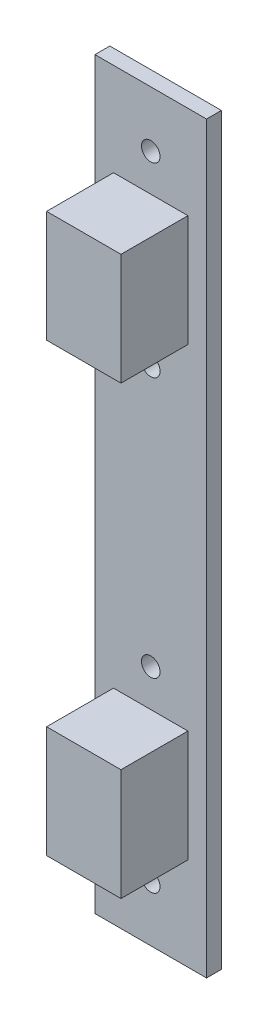
ISO-10303-21;
HEADER;
FILE_DESCRIPTION(('STEP AP214'),'2;1');
FILE_NAME('part.step','',(''),(''),'','','');
FILE_SCHEMA(('AUTOMOTIVE_DESIGN { 1 0 10303 214 1 1 1 1 }'));
ENDSEC;
DATA;
#1=APPLICATION_CONTEXT('core data for automotive mechanical design processes');
#2=APPLICATION_PROTOCOL_DEFINITION('international standard','automotive_design',2000,#1);
#3=PRODUCT_CONTEXT('',#1,'mechanical');
#4=PRODUCT('Part','Part','',(#3));
#5=PRODUCT_RELATED_PRODUCT_CATEGORY('part','',(#4));
#6=PRODUCT_DEFINITION_FORMATION('','',#4);
#7=PRODUCT_DEFINITION_CONTEXT('part definition',#1,'design');
#8=PRODUCT_DEFINITION('design','',#6,#7);
#9=PRODUCT_DEFINITION_SHAPE('','',#8);
#10=(LENGTH_UNIT() NAMED_UNIT(*) SI_UNIT(.MILLI.,.METRE.));
#11=(NAMED_UNIT(*) PLANE_ANGLE_UNIT() SI_UNIT($,.RADIAN.));
#12=(NAMED_UNIT(*) SI_UNIT($,.STERADIAN.) SOLID_ANGLE_UNIT());
#13=UNCERTAINTY_MEASURE_WITH_UNIT(LENGTH_MEASURE(1.E-05),#10,'distance_accuracy_value','');
#14=(GEOMETRIC_REPRESENTATION_CONTEXT(3) GLOBAL_UNCERTAINTY_ASSIGNED_CONTEXT((#13)) GLOBAL_UNIT_ASSIGNED_CONTEXT((#10,
#11,#12)) REPRESENTATION_CONTEXT('',''));
#15=CARTESIAN_POINT('',(0.,0.,0.));
#16=DIRECTION('',(0.,0.,1.));
#17=DIRECTION('',(1.,0.,0.));
#18=AXIS2_PLACEMENT_3D('',#15,#16,#17);
#19=CARTESIAN_POINT('',(0.,0.,0.));
#20=DIRECTION('',(0.,0.,-1.));
#21=DIRECTION('',(-1.,0.,0.));
#22=AXIS2_PLACEMENT_3D('',#19,#20,#21);
#23=PLANE('',#22);
#24=DIRECTION('',(0.,1.,0.));
#25=VECTOR('',#24,1.);
#26=CARTESIAN_POINT('',(5.,22.5,0.));
#27=LINE('',#26,#25);
#28=CARTESIAN_POINT('',(5.,22.5,0.));
#29=VERTEX_POINT('',#28);
#30=CARTESIAN_POINT('',(5.,37.5,0.));
#31=VERTEX_POINT('',#30);
#32=EDGE_CURVE('E146',#29,#31,#27,.T.);
#33=ORIENTED_EDGE('',*,*,#32,.F.);
#34=DIRECTION('',(1.,0.,0.));
#35=VECTOR('',#34,1.);
#36=CARTESIAN_POINT('',(-5.,22.5,0.));
#37=LINE('',#36,#35);
#38=CARTESIAN_POINT('',(-5.,22.5,0.));
#39=VERTEX_POINT('',#38);
#40=EDGE_CURVE('E159',#39,#29,#37,.T.);
#41=ORIENTED_EDGE('',*,*,#40,.F.);
#42=DIRECTION('',(0.,-1.,0.));
#43=VECTOR('',#42,1.);
#44=CARTESIAN_POINT('',(-5.,22.5,0.));
#45=LINE('',#44,#43);
#46=CARTESIAN_POINT('',(-5.,37.5,0.));
#47=VERTEX_POINT('',#46);
#48=EDGE_CURVE('E168',#47,#39,#45,.T.);
#49=ORIENTED_EDGE('',*,*,#48,.F.);
#50=DIRECTION('',(-1.,0.,0.));
#51=VECTOR('',#50,1.);
#52=CARTESIAN_POINT('',(-5.,37.5,0.));
#53=LINE('',#52,#51);
#54=EDGE_CURVE('E149',#31,#47,#53,.T.);
#55=ORIENTED_EDGE('',*,*,#54,.F.);
#56=EDGE_LOOP('',(#33,#41,#49,#55));
#57=FACE_BOUND('',#56,.T.);
#58=CARTESIAN_POINT('',(0.,-17.5,0.));
#59=DIRECTION('',(0.,0.,1.));
#60=DIRECTION('',(-1.,0.,0.));
#61=AXIS2_PLACEMENT_3D('',#58,#59,#60);
#62=CIRCLE('',#61,1.25);
#63=CARTESIAN_POINT('',(-1.25,-17.5,0.));
#64=VERTEX_POINT('',#63);
#65=EDGE_CURVE('E184',#64,#64,#62,.T.);
#66=ORIENTED_EDGE('',*,*,#65,.F.);
#67=EDGE_LOOP('',(#66));
#68=FACE_BOUND('',#67,.T.);
#69=CARTESIAN_POINT('',(0.,-42.5,0.));
#70=DIRECTION('',(0.,0.,1.));
#71=DIRECTION('',(-1.,0.,0.));
#72=AXIS2_PLACEMENT_3D('',#69,#70,#71);
#73=CIRCLE('',#72,1.25);
#74=CARTESIAN_POINT('',(-1.25,-42.5,0.));
#75=VERTEX_POINT('',#74);
#76=EDGE_CURVE('E188',#75,#75,#73,.T.);
#77=ORIENTED_EDGE('',*,*,#76,.F.);
#78=EDGE_LOOP('',(#77));
#79=FACE_BOUND('',#78,.T.);
#80=CARTESIAN_POINT('',(0.,17.5,0.));
#81=DIRECTION('',(0.,0.,1.));
#82=DIRECTION('',(1.,0.,0.));
#83=AXIS2_PLACEMENT_3D('',#80,#81,#82);
#84=CIRCLE('',#83,1.25);
#85=CARTESIAN_POINT('',(1.25,17.5,0.));
#86=VERTEX_POINT('',#85);
#87=EDGE_CURVE('E194',#86,#86,#84,.T.);
#88=ORIENTED_EDGE('',*,*,#87,.F.);
#89=EDGE_LOOP('',(#88));
#90=FACE_BOUND('',#89,.T.);
#91=CARTESIAN_POINT('',(0.,42.5,0.));
#92=DIRECTION('',(0.,0.,1.));
#93=DIRECTION('',(1.,0.,0.));
#94=AXIS2_PLACEMENT_3D('',#91,#92,#93);
#95=CIRCLE('',#94,1.25);
#96=CARTESIAN_POINT('',(1.25,42.5,0.));
#97=VERTEX_POINT('',#96);
#98=EDGE_CURVE('E200',#97,#97,#95,.T.);
#99=ORIENTED_EDGE('',*,*,#98,.F.);
#100=EDGE_LOOP('',(#99));
#101=FACE_BOUND('',#100,.T.);
#102=DIRECTION('',(0.,1.,0.));
#103=VECTOR('',#102,1.);
#104=CARTESIAN_POINT('',(7.5,-50.,0.));
#105=LINE('',#104,#103);
#106=CARTESIAN_POINT('',(7.5,-50.,0.));
#107=VERTEX_POINT('',#106);
#108=CARTESIAN_POINT('',(7.5,50.,0.));
#109=VERTEX_POINT('',#108);
#110=EDGE_CURVE('E206',#107,#109,#105,.T.);
#111=ORIENTED_EDGE('',*,*,#110,.T.);
#112=DIRECTION('',(-1.,0.,0.));
#113=VECTOR('',#112,1.);
#114=CARTESIAN_POINT('',(-7.5,50.,0.));
#115=LINE('',#114,#113);
#116=CARTESIAN_POINT('',(-7.5,50.,0.));
#117=VERTEX_POINT('',#116);
#118=EDGE_CURVE('E224',#109,#117,#115,.T.);
#119=ORIENTED_EDGE('',*,*,#118,.T.);
#120=DIRECTION('',(0.,-1.,0.));
#121=VECTOR('',#120,1.);
#122=CARTESIAN_POINT('',(-7.5,-50.,0.));
#123=LINE('',#122,#121);
#124=CARTESIAN_POINT('',(-7.5,-50.,0.));
#125=VERTEX_POINT('',#124);
#126=EDGE_CURVE('E227',#117,#125,#123,.T.);
#127=ORIENTED_EDGE('',*,*,#126,.T.);
#128=DIRECTION('',(1.,0.,0.));
#129=VECTOR('',#128,1.);
#130=CARTESIAN_POINT('',(-7.5,-50.,0.));
#131=LINE('',#130,#129);
#132=EDGE_CURVE('E213',#125,#107,#131,.T.);
#133=ORIENTED_EDGE('',*,*,#132,.T.);
#134=EDGE_LOOP('',(#111,#119,#127,#133));
#135=FACE_BOUND('',#134,.T.);
#136=DIRECTION('',(0.,-1.,0.));
#137=VECTOR('',#136,1.);
#138=CARTESIAN_POINT('',(-5.,-22.5,0.));
#139=LINE('',#138,#137);
#140=CARTESIAN_POINT('',(-5.,-22.5,0.));
#141=VERTEX_POINT('',#140);
#142=CARTESIAN_POINT('',(-5.,-37.5,0.));
#143=VERTEX_POINT('',#142);
#144=EDGE_CURVE('E145',#141,#143,#139,.T.);
#145=ORIENTED_EDGE('',*,*,#144,.F.);
#146=DIRECTION('',(-1.,0.,0.));
#147=VECTOR('',#146,1.);
#148=CARTESIAN_POINT('',(-5.,-22.5,0.));
#149=LINE('',#148,#147);
#150=CARTESIAN_POINT('',(5.,-22.5,0.));
#151=VERTEX_POINT('',#150);
#152=EDGE_CURVE('E142',#151,#141,#149,.T.);
#153=ORIENTED_EDGE('',*,*,#152,.F.);
#154=DIRECTION('',(0.,1.,0.));
#155=VECTOR('',#154,1.);
#156=CARTESIAN_POINT('',(5.,-22.5,0.));
#157=LINE('',#156,#155);
#158=CARTESIAN_POINT('',(5.,-37.5,0.));
#159=VERTEX_POINT('',#158);
#160=EDGE_CURVE('E57',#159,#151,#157,.T.);
#161=ORIENTED_EDGE('',*,*,#160,.F.);
#162=DIRECTION('',(1.,0.,0.));
#163=VECTOR('',#162,1.);
#164=CARTESIAN_POINT('',(-5.,-37.5,0.));
#165=LINE('',#164,#163);
#166=EDGE_CURVE('E52',#143,#159,#165,.T.);
#167=ORIENTED_EDGE('',*,*,#166,.F.);
#168=EDGE_LOOP('',(#145,#153,#161,#167));
#169=FACE_BOUND('',#168,.T.);
#170=ADVANCED_FACE('F35',(#57,#68,#79,#90,#101,#135,#169),#23,.F.);
#171=CARTESIAN_POINT('',(7.5,-50.,-2.));
#172=DIRECTION('',(1.,0.,0.));
#173=DIRECTION('',(0.,0.,-1.));
#174=AXIS2_PLACEMENT_3D('',#171,#172,#173);
#175=PLANE('',#174);
#176=ORIENTED_EDGE('',*,*,#110,.F.);
#177=DIRECTION('',(0.,0.,1.));
#178=VECTOR('',#177,1.);
#179=CARTESIAN_POINT('',(7.5,-50.,-2.));
#180=LINE('',#179,#178);
#181=CARTESIAN_POINT('',(7.5,-50.,-2.));
#182=VERTEX_POINT('',#181);
#183=EDGE_CURVE('E11',#182,#107,#180,.T.);
#184=ORIENTED_EDGE('',*,*,#183,.F.);
#185=DIRECTION('',(0.,1.,0.));
#186=VECTOR('',#185,1.);
#187=CARTESIAN_POINT('',(7.5,-50.,-2.));
#188=LINE('',#187,#186);
#189=CARTESIAN_POINT('',(7.5,50.,-2.));
#190=VERTEX_POINT('',#189);
#191=EDGE_CURVE('E209',#182,#190,#188,.T.);
#192=ORIENTED_EDGE('',*,*,#191,.T.);
#193=DIRECTION('',(0.,0.,1.));
#194=VECTOR('',#193,1.);
#195=CARTESIAN_POINT('',(7.5,50.,-2.));
#196=LINE('',#195,#194);
#197=EDGE_CURVE('E39',#190,#109,#196,.T.);
#198=ORIENTED_EDGE('',*,*,#197,.T.);
#199=EDGE_LOOP('',(#176,#184,#192,#198));
#200=FACE_BOUND('',#199,.T.);
#201=ADVANCED_FACE('F37',(#200),#175,.T.);
#202=CARTESIAN_POINT('',(-7.5,-50.,-2.));
#203=DIRECTION('',(0.,-1.,0.));
#204=DIRECTION('',(0.,0.,-1.));
#205=AXIS2_PLACEMENT_3D('',#202,#203,#204);
#206=PLANE('',#205);
#207=ORIENTED_EDGE('',*,*,#132,.F.);
#208=DIRECTION('',(0.,0.,1.));
#209=VECTOR('',#208,1.);
#210=CARTESIAN_POINT('',(-7.5,-50.,-2.));
#211=LINE('',#210,#209);
#212=CARTESIAN_POINT('',(-7.5,-50.,-2.));
#213=VERTEX_POINT('',#212);
#214=EDGE_CURVE('E44',#213,#125,#211,.T.);
#215=ORIENTED_EDGE('',*,*,#214,.F.);
#216=DIRECTION('',(1.,0.,0.));
#217=VECTOR('',#216,1.);
#218=CARTESIAN_POINT('',(-7.5,-50.,-2.));
#219=LINE('',#218,#217);
#220=EDGE_CURVE('E219',#213,#182,#219,.T.);
#221=ORIENTED_EDGE('',*,*,#220,.T.);
#222=ORIENTED_EDGE('',*,*,#183,.T.);
#223=EDGE_LOOP('',(#207,#215,#221,#222));
#224=FACE_BOUND('',#223,.T.);
#225=ADVANCED_FACE('F244',(#224),#206,.T.);
#226=CARTESIAN_POINT('',(-7.5,-50.,-2.));
#227=DIRECTION('',(-1.,0.,0.));
#228=DIRECTION('',(0.,0.,1.));
#229=AXIS2_PLACEMENT_3D('',#226,#227,#228);
#230=PLANE('',#229);
#231=ORIENTED_EDGE('',*,*,#126,.F.);
#232=DIRECTION('',(0.,0.,1.));
#233=VECTOR('',#232,1.);
#234=CARTESIAN_POINT('',(-7.5,50.,-2.));
#235=LINE('',#234,#233);
#236=CARTESIAN_POINT('',(-7.5,50.,-2.));
#237=VERTEX_POINT('',#236);
#238=EDGE_CURVE('E232',#237,#117,#235,.T.);
#239=ORIENTED_EDGE('',*,*,#238,.F.);
#240=DIRECTION('',(0.,-1.,0.));
#241=VECTOR('',#240,1.);
#242=CARTESIAN_POINT('',(-7.5,-50.,-2.));
#243=LINE('',#242,#241);
#244=EDGE_CURVE('E216',#237,#213,#243,.T.);
#245=ORIENTED_EDGE('',*,*,#244,.T.);
#246=ORIENTED_EDGE('',*,*,#214,.T.);
#247=EDGE_LOOP('',(#231,#239,#245,#246));
#248=FACE_BOUND('',#247,.T.);
#249=ADVANCED_FACE('F250',(#248),#230,.T.);
#250=CARTESIAN_POINT('',(-7.5,50.,-2.));
#251=DIRECTION('',(0.,1.,0.));
#252=DIRECTION('',(0.,0.,1.));
#253=AXIS2_PLACEMENT_3D('',#250,#251,#252);
#254=PLANE('',#253);
#255=ORIENTED_EDGE('',*,*,#118,.F.);
#256=ORIENTED_EDGE('',*,*,#197,.F.);
#257=DIRECTION('',(-1.,0.,0.));
#258=VECTOR('',#257,1.);
#259=CARTESIAN_POINT('',(-7.5,50.,-2.));
#260=LINE('',#259,#258);
#261=EDGE_CURVE('E212',#190,#237,#260,.T.);
#262=ORIENTED_EDGE('',*,*,#261,.T.);
#263=ORIENTED_EDGE('',*,*,#238,.T.);
#264=EDGE_LOOP('',(#255,#256,#262,#263));
#265=FACE_BOUND('',#264,.T.);
#266=ADVANCED_FACE('F240',(#265),#254,.T.);
#267=CARTESIAN_POINT('',(0.,0.,-2.));
#268=DIRECTION('',(0.,0.,-1.));
#269=DIRECTION('',(-1.,0.,0.));
#270=AXIS2_PLACEMENT_3D('',#267,#268,#269);
#271=PLANE('',#270);
#272=CARTESIAN_POINT('',(0.,-17.5,-2.));
#273=DIRECTION('',(0.,0.,1.));
#274=DIRECTION('',(-1.,0.,0.));
#275=AXIS2_PLACEMENT_3D('',#272,#273,#274);
#276=CIRCLE('',#275,1.25);
#277=CARTESIAN_POINT('',(-1.25,-17.5,-2.));
#278=VERTEX_POINT('',#277);
#279=EDGE_CURVE('E185',#278,#278,#276,.T.);
#280=ORIENTED_EDGE('',*,*,#279,.T.);
#281=EDGE_LOOP('',(#280));
#282=FACE_BOUND('',#281,.T.);
#283=CARTESIAN_POINT('',(0.,-42.5,-2.));
#284=DIRECTION('',(0.,0.,1.));
#285=DIRECTION('',(-1.,0.,0.));
#286=AXIS2_PLACEMENT_3D('',#283,#284,#285);
#287=CIRCLE('',#286,1.25);
#288=CARTESIAN_POINT('',(-1.25,-42.5,-2.));
#289=VERTEX_POINT('',#288);
#290=EDGE_CURVE('E191',#289,#289,#287,.T.);
#291=ORIENTED_EDGE('',*,*,#290,.T.);
#292=EDGE_LOOP('',(#291));
#293=FACE_BOUND('',#292,.T.);
#294=CARTESIAN_POINT('',(0.,17.5,-2.));
#295=DIRECTION('',(0.,0.,1.));
#296=DIRECTION('',(1.,0.,0.));
#297=AXIS2_PLACEMENT_3D('',#294,#295,#296);
#298=CIRCLE('',#297,1.25);
#299=CARTESIAN_POINT('',(1.25,17.5,-2.));
#300=VERTEX_POINT('',#299);
#301=EDGE_CURVE('E197',#300,#300,#298,.T.);
#302=ORIENTED_EDGE('',*,*,#301,.T.);
#303=EDGE_LOOP('',(#302));
#304=FACE_BOUND('',#303,.T.);
#305=CARTESIAN_POINT('',(0.,42.5,-2.));
#306=DIRECTION('',(0.,0.,1.));
#307=DIRECTION('',(1.,0.,0.));
#308=AXIS2_PLACEMENT_3D('',#305,#306,#307);
#309=CIRCLE('',#308,1.25);
#310=CARTESIAN_POINT('',(1.25,42.5,-2.));
#311=VERTEX_POINT('',#310);
#312=EDGE_CURVE('E203',#311,#311,#309,.T.);
#313=ORIENTED_EDGE('',*,*,#312,.T.);
#314=EDGE_LOOP('',(#313));
#315=FACE_BOUND('',#314,.T.);
#316=ORIENTED_EDGE('',*,*,#191,.F.);
#317=ORIENTED_EDGE('',*,*,#220,.F.);
#318=ORIENTED_EDGE('',*,*,#244,.F.);
#319=ORIENTED_EDGE('',*,*,#261,.F.);
#320=EDGE_LOOP('',(#316,#317,#318,#319));
#321=FACE_BOUND('',#320,.T.);
#322=ADVANCED_FACE('F247',(#282,#293,#304,#315,#321),#271,.T.);
#323=CARTESIAN_POINT('',(0.,42.5,-2.));
#324=DIRECTION('',(0.,0.,1.));
#325=DIRECTION('',(1.,0.,0.));
#326=AXIS2_PLACEMENT_3D('',#323,#324,#325);
#327=CYLINDRICAL_SURFACE('',#326,1.25);
#328=ORIENTED_EDGE('',*,*,#312,.F.);
#329=EDGE_LOOP('',(#328));
#330=FACE_BOUND('',#329,.T.);
#331=ORIENTED_EDGE('',*,*,#98,.T.);
#332=EDGE_LOOP('',(#331));
#333=FACE_BOUND('',#332,.T.);
#334=ADVANCED_FACE('F268',(#330,#333),#327,.F.);
#335=CARTESIAN_POINT('',(0.,17.5,-2.));
#336=DIRECTION('',(0.,0.,1.));
#337=DIRECTION('',(1.,0.,0.));
#338=AXIS2_PLACEMENT_3D('',#335,#336,#337);
#339=CYLINDRICAL_SURFACE('',#338,1.25);
#340=ORIENTED_EDGE('',*,*,#301,.F.);
#341=EDGE_LOOP('',(#340));
#342=FACE_BOUND('',#341,.T.);
#343=ORIENTED_EDGE('',*,*,#87,.T.);
#344=EDGE_LOOP('',(#343));
#345=FACE_BOUND('',#344,.T.);
#346=ADVANCED_FACE('F272',(#342,#345),#339,.F.);
#347=CARTESIAN_POINT('',(0.,-42.5,-2.));
#348=DIRECTION('',(0.,0.,1.));
#349=DIRECTION('',(1.,0.,0.));
#350=AXIS2_PLACEMENT_3D('',#347,#348,#349);
#351=CYLINDRICAL_SURFACE('',#350,1.25);
#352=ORIENTED_EDGE('',*,*,#290,.F.);
#353=EDGE_LOOP('',(#352));
#354=FACE_BOUND('',#353,.T.);
#355=ORIENTED_EDGE('',*,*,#76,.T.);
#356=EDGE_LOOP('',(#355));
#357=FACE_BOUND('',#356,.T.);
#358=ADVANCED_FACE('F276',(#354,#357),#351,.F.);
#359=CARTESIAN_POINT('',(0.,-17.5,-2.));
#360=DIRECTION('',(0.,0.,1.));
#361=DIRECTION('',(1.,0.,0.));
#362=AXIS2_PLACEMENT_3D('',#359,#360,#361);
#363=CYLINDRICAL_SURFACE('',#362,1.25);
#364=ORIENTED_EDGE('',*,*,#279,.F.);
#365=EDGE_LOOP('',(#364));
#366=FACE_BOUND('',#365,.T.);
#367=ORIENTED_EDGE('',*,*,#65,.T.);
#368=EDGE_LOOP('',(#367));
#369=FACE_BOUND('',#368,.T.);
#370=ADVANCED_FACE('F280',(#366,#369),#363,.F.);
#371=CARTESIAN_POINT('',(5.,22.5,9.));
#372=DIRECTION('',(-1.,0.,0.));
#373=DIRECTION('',(0.,0.,1.));
#374=AXIS2_PLACEMENT_3D('',#371,#372,#373);
#375=PLANE('',#374);
#376=ORIENTED_EDGE('',*,*,#32,.T.);
#377=DIRECTION('',(0.,0.,-1.));
#378=VECTOR('',#377,1.);
#379=CARTESIAN_POINT('',(5.,37.5,9.));
#380=LINE('',#379,#378);
#381=CARTESIAN_POINT('',(5.,37.5,9.));
#382=VERTEX_POINT('',#381);
#383=EDGE_CURVE('E181',#382,#31,#380,.T.);
#384=ORIENTED_EDGE('',*,*,#383,.F.);
#385=DIRECTION('',(0.,1.,0.));
#386=VECTOR('',#385,1.);
#387=CARTESIAN_POINT('',(5.,22.5,9.));
#388=LINE('',#387,#386);
#389=CARTESIAN_POINT('',(5.,22.5,9.));
#390=VERTEX_POINT('',#389);
#391=EDGE_CURVE('E155',#390,#382,#388,.T.);
#392=ORIENTED_EDGE('',*,*,#391,.F.);
#393=DIRECTION('',(0.,0.,-1.));
#394=VECTOR('',#393,1.);
#395=CARTESIAN_POINT('',(5.,22.5,9.));
#396=LINE('',#395,#394);
#397=EDGE_CURVE('E164',#390,#29,#396,.T.);
#398=ORIENTED_EDGE('',*,*,#397,.T.);
#399=EDGE_LOOP('',(#376,#384,#392,#398));
#400=FACE_BOUND('',#399,.T.);
#401=ADVANCED_FACE('F284',(#400),#375,.F.);
#402=CARTESIAN_POINT('',(-5.,37.5,9.));
#403=DIRECTION('',(0.,-1.,0.));
#404=DIRECTION('',(0.,0.,-1.));
#405=AXIS2_PLACEMENT_3D('',#402,#403,#404);
#406=PLANE('',#405);
#407=ORIENTED_EDGE('',*,*,#54,.T.);
#408=DIRECTION('',(0.,0.,-1.));
#409=VECTOR('',#408,1.);
#410=CARTESIAN_POINT('',(-5.,37.5,9.));
#411=LINE('',#410,#409);
#412=CARTESIAN_POINT('',(-5.,37.5,9.));
#413=VERTEX_POINT('',#412);
#414=EDGE_CURVE('E178',#413,#47,#411,.T.);
#415=ORIENTED_EDGE('',*,*,#414,.F.);
#416=DIRECTION('',(-1.,0.,0.));
#417=VECTOR('',#416,1.);
#418=CARTESIAN_POINT('',(-5.,37.5,9.));
#419=LINE('',#418,#417);
#420=EDGE_CURVE('E158',#382,#413,#419,.T.);
#421=ORIENTED_EDGE('',*,*,#420,.F.);
#422=ORIENTED_EDGE('',*,*,#383,.T.);
#423=EDGE_LOOP('',(#407,#415,#421,#422));
#424=FACE_BOUND('',#423,.T.);
#425=ADVANCED_FACE('F288',(#424),#406,.F.);
#426=CARTESIAN_POINT('',(-5.,22.5,9.));
#427=DIRECTION('',(1.,0.,0.));
#428=DIRECTION('',(0.,0.,-1.));
#429=AXIS2_PLACEMENT_3D('',#426,#427,#428);
#430=PLANE('',#429);
#431=ORIENTED_EDGE('',*,*,#48,.T.);
#432=DIRECTION('',(0.,0.,-1.));
#433=VECTOR('',#432,1.);
#434=CARTESIAN_POINT('',(-5.,22.5,9.));
#435=LINE('',#434,#433);
#436=CARTESIAN_POINT('',(-5.,22.5,9.));
#437=VERTEX_POINT('',#436);
#438=EDGE_CURVE('E175',#437,#39,#435,.T.);
#439=ORIENTED_EDGE('',*,*,#438,.F.);
#440=DIRECTION('',(0.,-1.,0.));
#441=VECTOR('',#440,1.);
#442=CARTESIAN_POINT('',(-5.,22.5,9.));
#443=LINE('',#442,#441);
#444=EDGE_CURVE('E161',#413,#437,#443,.T.);
#445=ORIENTED_EDGE('',*,*,#444,.F.);
#446=ORIENTED_EDGE('',*,*,#414,.T.);
#447=EDGE_LOOP('',(#431,#439,#445,#446));
#448=FACE_BOUND('',#447,.T.);
#449=ADVANCED_FACE('F292',(#448),#430,.F.);
#450=CARTESIAN_POINT('',(-5.,22.5,9.));
#451=DIRECTION('',(0.,1.,0.));
#452=DIRECTION('',(-1.,0.,0.));
#453=AXIS2_PLACEMENT_3D('',#450,#451,#452);
#454=PLANE('',#453);
#455=ORIENTED_EDGE('',*,*,#40,.T.);
#456=ORIENTED_EDGE('',*,*,#397,.F.);
#457=DIRECTION('',(1.,0.,0.));
#458=VECTOR('',#457,1.);
#459=CARTESIAN_POINT('',(-5.,22.5,9.));
#460=LINE('',#459,#458);
#461=EDGE_CURVE('E163',#437,#390,#460,.T.);
#462=ORIENTED_EDGE('',*,*,#461,.F.);
#463=ORIENTED_EDGE('',*,*,#438,.T.);
#464=EDGE_LOOP('',(#455,#456,#462,#463));
#465=FACE_BOUND('',#464,.T.);
#466=ADVANCED_FACE('F296',(#465),#454,.F.);
#467=CARTESIAN_POINT('',(0.,0.,9.));
#468=DIRECTION('',(0.,0.,-1.));
#469=DIRECTION('',(-1.,0.,0.));
#470=AXIS2_PLACEMENT_3D('',#467,#468,#469);
#471=PLANE('',#470);
#472=ORIENTED_EDGE('',*,*,#391,.T.);
#473=ORIENTED_EDGE('',*,*,#420,.T.);
#474=ORIENTED_EDGE('',*,*,#444,.T.);
#475=ORIENTED_EDGE('',*,*,#461,.T.);
#476=EDGE_LOOP('',(#472,#473,#474,#475));
#477=FACE_BOUND('',#476,.T.);
#478=ADVANCED_FACE('F300',(#477),#471,.F.);
#479=CARTESIAN_POINT('',(-5.,-22.5,9.));
#480=DIRECTION('',(1.,0.,0.));
#481=DIRECTION('',(0.,0.,-1.));
#482=AXIS2_PLACEMENT_3D('',#479,#480,#481);
#483=PLANE('',#482);
#484=ORIENTED_EDGE('',*,*,#144,.T.);
#485=DIRECTION('',(0.,0.,-1.));
#486=VECTOR('',#485,1.);
#487=CARTESIAN_POINT('',(-5.,-37.5,9.));
#488=LINE('',#487,#486);
#489=CARTESIAN_POINT('',(-5.,-37.5,9.));
#490=VERTEX_POINT('',#489);
#491=EDGE_CURVE('E126',#490,#143,#488,.T.);
#492=ORIENTED_EDGE('',*,*,#491,.F.);
#493=DIRECTION('',(0.,-1.,0.));
#494=VECTOR('',#493,1.);
#495=CARTESIAN_POINT('',(-5.,-22.5,9.));
#496=LINE('',#495,#494);
#497=CARTESIAN_POINT('',(-5.,-22.5,9.));
#498=VERTEX_POINT('',#497);
#499=EDGE_CURVE('E133',#498,#490,#496,.T.);
#500=ORIENTED_EDGE('',*,*,#499,.F.);
#501=DIRECTION('',(0.,0.,-1.));
#502=VECTOR('',#501,1.);
#503=CARTESIAN_POINT('',(-5.,-22.5,9.));
#504=LINE('',#503,#502);
#505=EDGE_CURVE('E436',#498,#141,#504,.T.);
#506=ORIENTED_EDGE('',*,*,#505,.T.);
#507=EDGE_LOOP('',(#484,#492,#500,#506));
#508=FACE_BOUND('',#507,.T.);
#509=ADVANCED_FACE('F144',(#508),#483,.F.);
#510=CARTESIAN_POINT('',(-5.,-37.5,9.));
#511=DIRECTION('',(0.,1.,0.));
#512=DIRECTION('',(0.,0.,1.));
#513=AXIS2_PLACEMENT_3D('',#510,#511,#512);
#514=PLANE('',#513);
#515=ORIENTED_EDGE('',*,*,#166,.T.);
#516=DIRECTION('',(0.,0.,-1.));
#517=VECTOR('',#516,1.);
#518=CARTESIAN_POINT('',(5.,-37.5,9.));
#519=LINE('',#518,#517);
#520=CARTESIAN_POINT('',(5.,-37.5,9.));
#521=VERTEX_POINT('',#520);
#522=EDGE_CURVE('E129',#521,#159,#519,.T.);
#523=ORIENTED_EDGE('',*,*,#522,.F.);
#524=DIRECTION('',(1.,0.,0.));
#525=VECTOR('',#524,1.);
#526=CARTESIAN_POINT('',(-5.,-37.5,9.));
#527=LINE('',#526,#525);
#528=EDGE_CURVE('E122',#490,#521,#527,.T.);
#529=ORIENTED_EDGE('',*,*,#528,.F.);
#530=ORIENTED_EDGE('',*,*,#491,.T.);
#531=EDGE_LOOP('',(#515,#523,#529,#530));
#532=FACE_BOUND('',#531,.T.);
#533=ADVANCED_FACE('F124',(#532),#514,.F.);
#534=CARTESIAN_POINT('',(5.,-22.5,9.));
#535=DIRECTION('',(-1.,0.,0.));
#536=DIRECTION('',(0.,0.,1.));
#537=AXIS2_PLACEMENT_3D('',#534,#535,#536);
#538=PLANE('',#537);
#539=ORIENTED_EDGE('',*,*,#160,.T.);
#540=DIRECTION('',(0.,0.,-1.));
#541=VECTOR('',#540,1.);
#542=CARTESIAN_POINT('',(5.,-22.5,9.));
#543=LINE('',#542,#541);
#544=CARTESIAN_POINT('',(5.,-22.5,9.));
#545=VERTEX_POINT('',#544);
#546=EDGE_CURVE('E151',#545,#151,#543,.T.);
#547=ORIENTED_EDGE('',*,*,#546,.F.);
#548=DIRECTION('',(0.,1.,0.));
#549=VECTOR('',#548,1.);
#550=CARTESIAN_POINT('',(5.,-22.5,9.));
#551=LINE('',#550,#549);
#552=EDGE_CURVE('E132',#521,#545,#551,.T.);
#553=ORIENTED_EDGE('',*,*,#552,.F.);
#554=ORIENTED_EDGE('',*,*,#522,.T.);
#555=EDGE_LOOP('',(#539,#547,#553,#554));
#556=FACE_BOUND('',#555,.T.);
#557=ADVANCED_FACE('F309',(#556),#538,.F.);
#558=CARTESIAN_POINT('',(-5.,-22.5,9.));
#559=DIRECTION('',(0.,-1.,0.));
#560=DIRECTION('',(1.,0.,0.));
#561=AXIS2_PLACEMENT_3D('',#558,#559,#560);
#562=PLANE('',#561);
#563=ORIENTED_EDGE('',*,*,#152,.T.);
#564=ORIENTED_EDGE('',*,*,#505,.F.);
#565=DIRECTION('',(-1.,0.,0.));
#566=VECTOR('',#565,1.);
#567=CARTESIAN_POINT('',(-5.,-22.5,9.));
#568=LINE('',#567,#566);
#569=EDGE_CURVE('E138',#545,#498,#568,.T.);
#570=ORIENTED_EDGE('',*,*,#569,.F.);
#571=ORIENTED_EDGE('',*,*,#546,.T.);
#572=EDGE_LOOP('',(#563,#564,#570,#571));
#573=FACE_BOUND('',#572,.T.);
#574=ADVANCED_FACE('F312',(#573),#562,.F.);
#575=CARTESIAN_POINT('',(0.,0.,9.));
#576=DIRECTION('',(0.,0.,1.));
#577=DIRECTION('',(1.,0.,0.));
#578=AXIS2_PLACEMENT_3D('',#575,#576,#577);
#579=PLANE('',#578);
#580=ORIENTED_EDGE('',*,*,#499,.T.);
#581=ORIENTED_EDGE('',*,*,#528,.T.);
#582=ORIENTED_EDGE('',*,*,#552,.T.);
#583=ORIENTED_EDGE('',*,*,#569,.T.);
#584=EDGE_LOOP('',(#580,#581,#582,#583));
#585=FACE_BOUND('',#584,.T.);
#586=ADVANCED_FACE('F136',(#585),#579,.T.);
#587=CLOSED_SHELL('',(#170,#201,#225,#249,#266,#322,#334,#346,#358,#370,#401,#425,#449,#466,
#478,#509,#533,#557,#574,#586));
#588=MANIFOLD_SOLID_BREP('B2',#587);
#589=ADVANCED_BREP_SHAPE_REPRESENTATION('',(#18,#588),#14);
#590=SHAPE_DEFINITION_REPRESENTATION(#9,#589);
ENDSEC;
END-ISO-10303-21;
